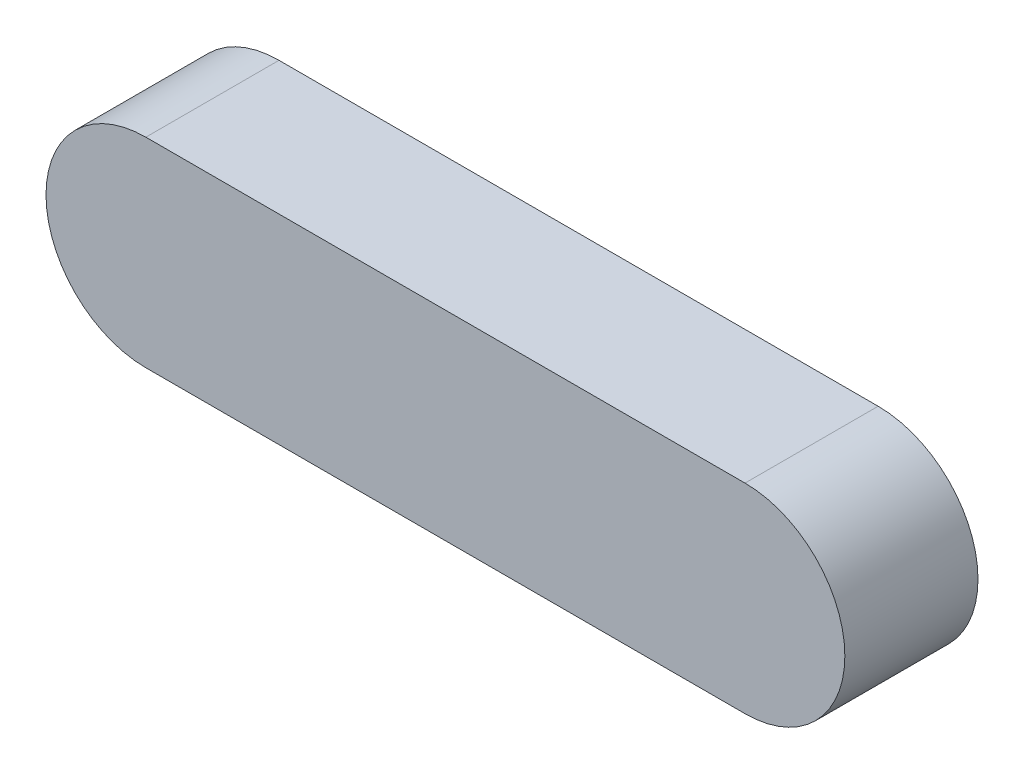
ISO-10303-21;
HEADER;
FILE_DESCRIPTION(('STEP AP214'),'2;1');
FILE_NAME('part.step','',(''),(''),'','','');
FILE_SCHEMA(('AUTOMOTIVE_DESIGN { 1 0 10303 214 1 1 1 1 }'));
ENDSEC;
DATA;
#1=APPLICATION_CONTEXT('core data for automotive mechanical design processes');
#2=APPLICATION_PROTOCOL_DEFINITION('international standard','automotive_design',2000,#1);
#3=PRODUCT_CONTEXT('',#1,'mechanical');
#4=PRODUCT('Part','Part','',(#3));
#5=PRODUCT_RELATED_PRODUCT_CATEGORY('part','',(#4));
#6=PRODUCT_DEFINITION_FORMATION('','',#4);
#7=PRODUCT_DEFINITION_CONTEXT('part definition',#1,'design');
#8=PRODUCT_DEFINITION('design','',#6,#7);
#9=PRODUCT_DEFINITION_SHAPE('','',#8);
#10=(LENGTH_UNIT() NAMED_UNIT(*) SI_UNIT(.MILLI.,.METRE.));
#11=(NAMED_UNIT(*) PLANE_ANGLE_UNIT() SI_UNIT($,.RADIAN.));
#12=(NAMED_UNIT(*) SI_UNIT($,.STERADIAN.) SOLID_ANGLE_UNIT());
#13=UNCERTAINTY_MEASURE_WITH_UNIT(LENGTH_MEASURE(1.E-05),#10,'distance_accuracy_value','');
#14=(GEOMETRIC_REPRESENTATION_CONTEXT(3) GLOBAL_UNCERTAINTY_ASSIGNED_CONTEXT((#13)) GLOBAL_UNIT_ASSIGNED_CONTEXT((#10,
#11,#12)) REPRESENTATION_CONTEXT('',''));
#15=CARTESIAN_POINT('',(0.,0.,0.));
#16=DIRECTION('',(0.,0.,1.));
#17=DIRECTION('',(1.,0.,0.));
#18=AXIS2_PLACEMENT_3D('',#15,#16,#17);
#19=CARTESIAN_POINT('',(-3.61904761904762,0.,8.));
#20=DIRECTION('',(0.,0.,-1.));
#21=DIRECTION('',(-1.,0.,0.));
#22=AXIS2_PLACEMENT_3D('',#19,#20,#21);
#23=CYLINDRICAL_SURFACE('',#22,6.);
#24=CARTESIAN_POINT('',(-3.61904761904762,0.,0.));
#25=DIRECTION('',(0.,0.,1.));
#26=DIRECTION('',(1.,0.,0.));
#27=AXIS2_PLACEMENT_3D('',#24,#25,#26);
#28=CIRCLE('',#27,6.);
#29=CARTESIAN_POINT('',(-3.61904761904762,6.,0.));
#30=VERTEX_POINT('',#29);
#31=CARTESIAN_POINT('',(-3.61904761904762,-6.,0.));
#32=VERTEX_POINT('',#31);
#33=EDGE_CURVE('E107',#30,#32,#28,.T.);
#34=ORIENTED_EDGE('',*,*,#33,.T.);
#35=DIRECTION('',(0.,0.,-1.));
#36=VECTOR('',#35,1.);
#37=CARTESIAN_POINT('',(-3.61904761904762,-6.,8.));
#38=LINE('',#37,#36);
#39=CARTESIAN_POINT('',(-3.61904761904762,-6.,8.));
#40=VERTEX_POINT('',#39);
#41=EDGE_CURVE('E11',#40,#32,#38,.T.);
#42=ORIENTED_EDGE('',*,*,#41,.F.);
#43=CARTESIAN_POINT('',(-3.61904761904762,0.,8.));
#44=DIRECTION('',(0.,0.,1.));
#45=DIRECTION('',(1.,0.,0.));
#46=AXIS2_PLACEMENT_3D('',#43,#44,#45);
#47=CIRCLE('',#46,6.);
#48=CARTESIAN_POINT('',(-3.61904761904762,6.,8.));
#49=VERTEX_POINT('',#48);
#50=EDGE_CURVE('E91',#49,#40,#47,.T.);
#51=ORIENTED_EDGE('',*,*,#50,.F.);
#52=DIRECTION('',(0.,0.,-1.));
#53=VECTOR('',#52,1.);
#54=CARTESIAN_POINT('',(-3.61904761904762,6.,8.));
#55=LINE('',#54,#53);
#56=EDGE_CURVE('E103',#49,#30,#55,.T.);
#57=ORIENTED_EDGE('',*,*,#56,.T.);
#58=EDGE_LOOP('',(#34,#42,#51,#57));
#59=FACE_BOUND('',#58,.T.);
#60=ADVANCED_FACE('F39',(#59),#23,.T.);
#61=CARTESIAN_POINT('',(-3.61904761904762,-6.,8.));
#62=DIRECTION('',(0.,1.,0.));
#63=DIRECTION('',(0.,0.,1.));
#64=AXIS2_PLACEMENT_3D('',#61,#62,#63);
#65=PLANE('',#64);
#66=DIRECTION('',(1.,0.,0.));
#67=VECTOR('',#66,1.);
#68=CARTESIAN_POINT('',(-3.61904761904762,-6.,0.));
#69=LINE('',#68,#67);
#70=CARTESIAN_POINT('',(32.3809523809524,-6.,0.));
#71=VERTEX_POINT('',#70);
#72=EDGE_CURVE('E96',#32,#71,#69,.T.);
#73=ORIENTED_EDGE('',*,*,#72,.T.);
#74=DIRECTION('',(0.,0.,-1.));
#75=VECTOR('',#74,1.);
#76=CARTESIAN_POINT('',(32.3809523809524,-6.,8.));
#77=LINE('',#76,#75);
#78=CARTESIAN_POINT('',(32.3809523809524,-6.,8.));
#79=VERTEX_POINT('',#78);
#80=EDGE_CURVE('E48',#79,#71,#77,.T.);
#81=ORIENTED_EDGE('',*,*,#80,.F.);
#82=DIRECTION('',(1.,0.,0.));
#83=VECTOR('',#82,1.);
#84=CARTESIAN_POINT('',(-3.61904761904762,-6.,8.));
#85=LINE('',#84,#83);
#86=EDGE_CURVE('E86',#40,#79,#85,.T.);
#87=ORIENTED_EDGE('',*,*,#86,.F.);
#88=ORIENTED_EDGE('',*,*,#41,.T.);
#89=EDGE_LOOP('',(#73,#81,#87,#88));
#90=FACE_BOUND('',#89,.T.);
#91=ADVANCED_FACE('F95',(#90),#65,.F.);
#92=CARTESIAN_POINT('',(32.3809523809524,0.,8.));
#93=DIRECTION('',(0.,0.,-1.));
#94=DIRECTION('',(-1.,0.,0.));
#95=AXIS2_PLACEMENT_3D('',#92,#93,#94);
#96=CYLINDRICAL_SURFACE('',#95,6.);
#97=CARTESIAN_POINT('',(32.3809523809524,0.,0.));
#98=DIRECTION('',(0.,0.,1.));
#99=DIRECTION('',(1.,0.,0.));
#100=AXIS2_PLACEMENT_3D('',#97,#98,#99);
#101=CIRCLE('',#100,6.);
#102=CARTESIAN_POINT('',(32.3809523809524,6.,0.));
#103=VERTEX_POINT('',#102);
#104=EDGE_CURVE('E73',#71,#103,#101,.T.);
#105=ORIENTED_EDGE('',*,*,#104,.T.);
#106=DIRECTION('',(0.,0.,-1.));
#107=VECTOR('',#106,1.);
#108=CARTESIAN_POINT('',(32.3809523809524,6.,8.));
#109=LINE('',#108,#107);
#110=CARTESIAN_POINT('',(32.3809523809524,6.,8.));
#111=VERTEX_POINT('',#110);
#112=EDGE_CURVE('E98',#111,#103,#109,.T.);
#113=ORIENTED_EDGE('',*,*,#112,.F.);
#114=CARTESIAN_POINT('',(32.3809523809524,0.,8.));
#115=DIRECTION('',(0.,0.,1.));
#116=DIRECTION('',(1.,0.,0.));
#117=AXIS2_PLACEMENT_3D('',#114,#115,#116);
#118=CIRCLE('',#117,6.);
#119=EDGE_CURVE('E89',#79,#111,#118,.T.);
#120=ORIENTED_EDGE('',*,*,#119,.F.);
#121=ORIENTED_EDGE('',*,*,#80,.T.);
#122=EDGE_LOOP('',(#105,#113,#120,#121));
#123=FACE_BOUND('',#122,.T.);
#124=ADVANCED_FACE('F99',(#123),#96,.T.);
#125=CARTESIAN_POINT('',(-3.61904761904762,6.,8.));
#126=DIRECTION('',(0.,-1.,0.));
#127=DIRECTION('',(0.,0.,-1.));
#128=AXIS2_PLACEMENT_3D('',#125,#126,#127);
#129=PLANE('',#128);
#130=DIRECTION('',(-1.,0.,0.));
#131=VECTOR('',#130,1.);
#132=CARTESIAN_POINT('',(-3.61904761904762,6.,0.));
#133=LINE('',#132,#131);
#134=EDGE_CURVE('E79',#103,#30,#133,.T.);
#135=ORIENTED_EDGE('',*,*,#134,.T.);
#136=ORIENTED_EDGE('',*,*,#56,.F.);
#137=DIRECTION('',(-1.,0.,0.));
#138=VECTOR('',#137,1.);
#139=CARTESIAN_POINT('',(-3.61904761904762,6.,8.));
#140=LINE('',#139,#138);
#141=EDGE_CURVE('E56',#111,#49,#140,.T.);
#142=ORIENTED_EDGE('',*,*,#141,.F.);
#143=ORIENTED_EDGE('',*,*,#112,.T.);
#144=EDGE_LOOP('',(#135,#136,#142,#143));
#145=FACE_BOUND('',#144,.T.);
#146=ADVANCED_FACE('F120',(#145),#129,.F.);
#147=CARTESIAN_POINT('',(-3.61904761904762,0.,8.));
#148=DIRECTION('',(0.,0.,1.));
#149=DIRECTION('',(1.,0.,0.));
#150=AXIS2_PLACEMENT_3D('',#147,#148,#149);
#151=PLANE('',#150);
#152=ORIENTED_EDGE('',*,*,#50,.T.);
#153=ORIENTED_EDGE('',*,*,#86,.T.);
#154=ORIENTED_EDGE('',*,*,#119,.T.);
#155=ORIENTED_EDGE('',*,*,#141,.T.);
#156=EDGE_LOOP('',(#152,#153,#154,#155));
#157=FACE_BOUND('',#156,.T.);
#158=ADVANCED_FACE('F87',(#157),#151,.T.);
#159=CARTESIAN_POINT('',(-3.61904761904762,0.,0.));
#160=DIRECTION('',(0.,0.,1.));
#161=DIRECTION('',(1.,0.,0.));
#162=AXIS2_PLACEMENT_3D('',#159,#160,#161);
#163=PLANE('',#162);
#164=ORIENTED_EDGE('',*,*,#33,.F.);
#165=ORIENTED_EDGE('',*,*,#134,.F.);
#166=ORIENTED_EDGE('',*,*,#104,.F.);
#167=ORIENTED_EDGE('',*,*,#72,.F.);
#168=EDGE_LOOP('',(#164,#165,#166,#167));
#169=FACE_BOUND('',#168,.T.);
#170=ADVANCED_FACE('F123',(#169),#163,.F.);
#171=CLOSED_SHELL('',(#60,#91,#124,#146,#158,#170));
#172=MANIFOLD_SOLID_BREP('B2',#171);
#173=ADVANCED_BREP_SHAPE_REPRESENTATION('',(#18,#172),#14);
#174=SHAPE_DEFINITION_REPRESENTATION(#9,#173);
ENDSEC;
END-ISO-10303-21;
